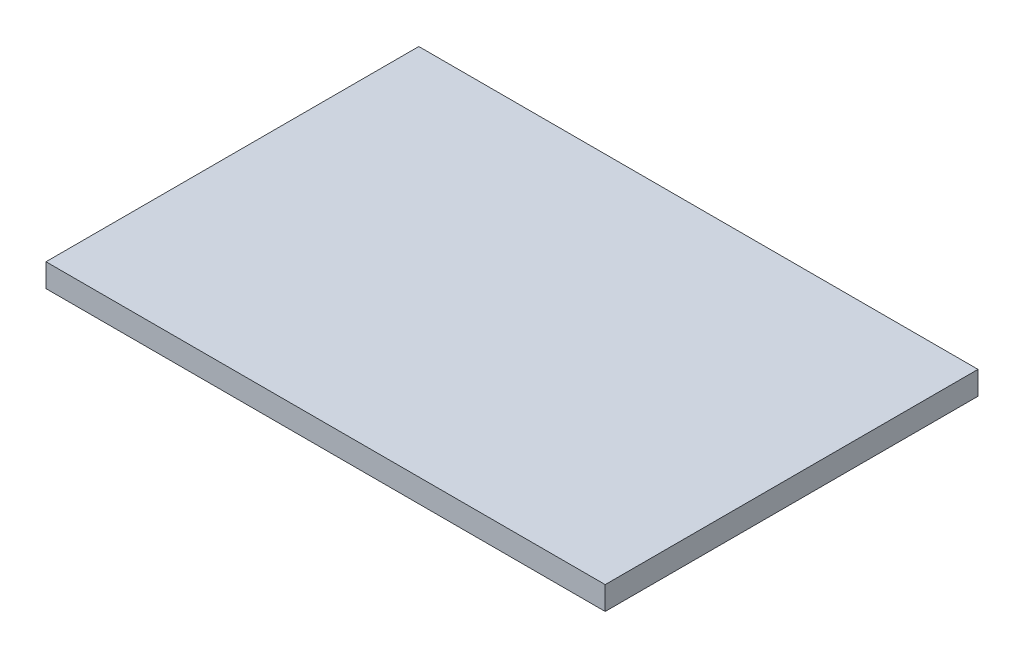
ISO-10303-21;
HEADER;
FILE_DESCRIPTION(('STEP AP214'),'2;1');
FILE_NAME('part.step','',(''),(''),'','','');
FILE_SCHEMA(('AUTOMOTIVE_DESIGN { 1 0 10303 214 1 1 1 1 }'));
ENDSEC;
DATA;
#1=APPLICATION_CONTEXT('core data for automotive mechanical design processes');
#2=APPLICATION_PROTOCOL_DEFINITION('international standard','automotive_design',2000,#1);
#3=PRODUCT_CONTEXT('',#1,'mechanical');
#4=PRODUCT('Part','Part','',(#3));
#5=PRODUCT_RELATED_PRODUCT_CATEGORY('part','',(#4));
#6=PRODUCT_DEFINITION_FORMATION('','',#4);
#7=PRODUCT_DEFINITION_CONTEXT('part definition',#1,'design');
#8=PRODUCT_DEFINITION('design','',#6,#7);
#9=PRODUCT_DEFINITION_SHAPE('','',#8);
#10=(LENGTH_UNIT() NAMED_UNIT(*) SI_UNIT(.MILLI.,.METRE.));
#11=(NAMED_UNIT(*) PLANE_ANGLE_UNIT() SI_UNIT($,.RADIAN.));
#12=(NAMED_UNIT(*) SI_UNIT($,.STERADIAN.) SOLID_ANGLE_UNIT());
#13=UNCERTAINTY_MEASURE_WITH_UNIT(LENGTH_MEASURE(1.E-05),#10,'distance_accuracy_value','');
#14=(GEOMETRIC_REPRESENTATION_CONTEXT(3) GLOBAL_UNCERTAINTY_ASSIGNED_CONTEXT((#13)) GLOBAL_UNIT_ASSIGNED_CONTEXT((#10,
#11,#12)) REPRESENTATION_CONTEXT('',''));
#15=CARTESIAN_POINT('',(0.,0.,0.));
#16=DIRECTION('',(0.,0.,1.));
#17=DIRECTION('',(1.,0.,0.));
#18=AXIS2_PLACEMENT_3D('',#15,#16,#17);
#19=CARTESIAN_POINT('',(0.,6.35,0.));
#20=DIRECTION('',(1.,0.,0.));
#21=DIRECTION('',(0.,0.,-1.));
#22=AXIS2_PLACEMENT_3D('',#19,#20,#21);
#23=PLANE('',#22);
#24=DIRECTION('',(0.,0.,1.));
#25=VECTOR('',#24,1.);
#26=CARTESIAN_POINT('',(0.,0.,0.));
#27=LINE('',#26,#25);
#28=CARTESIAN_POINT('',(0.,0.,-101.6));
#29=VERTEX_POINT('',#28);
#30=CARTESIAN_POINT('',(0.,0.,0.));
#31=VERTEX_POINT('',#30);
#32=EDGE_CURVE('E98',#29,#31,#27,.T.);
#33=ORIENTED_EDGE('',*,*,#32,.T.);
#34=DIRECTION('',(0.,-1.,0.));
#35=VECTOR('',#34,1.);
#36=CARTESIAN_POINT('',(0.,6.35,0.));
#37=LINE('',#36,#35);
#38=CARTESIAN_POINT('',(0.,6.35,0.));
#39=VERTEX_POINT('',#38);
#40=EDGE_CURVE('E11',#39,#31,#37,.T.);
#41=ORIENTED_EDGE('',*,*,#40,.F.);
#42=DIRECTION('',(0.,0.,1.));
#43=VECTOR('',#42,1.);
#44=CARTESIAN_POINT('',(0.,6.35,0.));
#45=LINE('',#44,#43);
#46=CARTESIAN_POINT('',(0.,6.35,-101.6));
#47=VERTEX_POINT('',#46);
#48=EDGE_CURVE('E86',#47,#39,#45,.T.);
#49=ORIENTED_EDGE('',*,*,#48,.F.);
#50=DIRECTION('',(0.,-1.,0.));
#51=VECTOR('',#50,1.);
#52=CARTESIAN_POINT('',(0.,6.35,-101.6));
#53=LINE('',#52,#51);
#54=EDGE_CURVE('E94',#47,#29,#53,.T.);
#55=ORIENTED_EDGE('',*,*,#54,.T.);
#56=EDGE_LOOP('',(#33,#41,#49,#55));
#57=FACE_BOUND('',#56,.T.);
#58=ADVANCED_FACE('F35',(#57),#23,.F.);
#59=CARTESIAN_POINT('',(0.,6.35,0.));
#60=DIRECTION('',(0.,0.,-1.));
#61=DIRECTION('',(-1.,0.,0.));
#62=AXIS2_PLACEMENT_3D('',#59,#60,#61);
#63=PLANE('',#62);
#64=DIRECTION('',(1.,0.,0.));
#65=VECTOR('',#64,1.);
#66=CARTESIAN_POINT('',(0.,0.,0.));
#67=LINE('',#66,#65);
#68=CARTESIAN_POINT('',(152.4,0.,0.));
#69=VERTEX_POINT('',#68);
#70=EDGE_CURVE('E90',#31,#69,#67,.T.);
#71=ORIENTED_EDGE('',*,*,#70,.T.);
#72=DIRECTION('',(0.,-1.,0.));
#73=VECTOR('',#72,1.);
#74=CARTESIAN_POINT('',(152.4,6.35,0.));
#75=LINE('',#74,#73);
#76=CARTESIAN_POINT('',(152.4,6.35,0.));
#77=VERTEX_POINT('',#76);
#78=EDGE_CURVE('E43',#77,#69,#75,.T.);
#79=ORIENTED_EDGE('',*,*,#78,.F.);
#80=DIRECTION('',(1.,0.,0.));
#81=VECTOR('',#80,1.);
#82=CARTESIAN_POINT('',(0.,6.35,0.));
#83=LINE('',#82,#81);
#84=EDGE_CURVE('E81',#39,#77,#83,.T.);
#85=ORIENTED_EDGE('',*,*,#84,.F.);
#86=ORIENTED_EDGE('',*,*,#40,.T.);
#87=EDGE_LOOP('',(#71,#79,#85,#86));
#88=FACE_BOUND('',#87,.T.);
#89=ADVANCED_FACE('F89',(#88),#63,.F.);
#90=CARTESIAN_POINT('',(152.4,6.35,0.));
#91=DIRECTION('',(-1.,0.,0.));
#92=DIRECTION('',(0.,0.,1.));
#93=AXIS2_PLACEMENT_3D('',#90,#91,#92);
#94=PLANE('',#93);
#95=DIRECTION('',(0.,0.,-1.));
#96=VECTOR('',#95,1.);
#97=CARTESIAN_POINT('',(152.4,0.,0.));
#98=LINE('',#97,#96);
#99=CARTESIAN_POINT('',(152.4,0.,-101.6));
#100=VERTEX_POINT('',#99);
#101=EDGE_CURVE('E68',#69,#100,#98,.T.);
#102=ORIENTED_EDGE('',*,*,#101,.T.);
#103=DIRECTION('',(0.,-1.,0.));
#104=VECTOR('',#103,1.);
#105=CARTESIAN_POINT('',(152.4,6.35,-101.6));
#106=LINE('',#105,#104);
#107=CARTESIAN_POINT('',(152.4,6.35,-101.6));
#108=VERTEX_POINT('',#107);
#109=EDGE_CURVE('E91',#108,#100,#106,.T.);
#110=ORIENTED_EDGE('',*,*,#109,.F.);
#111=DIRECTION('',(0.,0.,-1.));
#112=VECTOR('',#111,1.);
#113=CARTESIAN_POINT('',(152.4,6.35,0.));
#114=LINE('',#113,#112);
#115=EDGE_CURVE('E84',#77,#108,#114,.T.);
#116=ORIENTED_EDGE('',*,*,#115,.F.);
#117=ORIENTED_EDGE('',*,*,#78,.T.);
#118=EDGE_LOOP('',(#102,#110,#116,#117));
#119=FACE_BOUND('',#118,.T.);
#120=ADVANCED_FACE('F92',(#119),#94,.F.);
#121=CARTESIAN_POINT('',(0.,6.35,-101.6));
#122=DIRECTION('',(0.,0.,1.));
#123=DIRECTION('',(1.,0.,0.));
#124=AXIS2_PLACEMENT_3D('',#121,#122,#123);
#125=PLANE('',#124);
#126=DIRECTION('',(-1.,0.,0.));
#127=VECTOR('',#126,1.);
#128=CARTESIAN_POINT('',(0.,0.,-101.6));
#129=LINE('',#128,#127);
#130=EDGE_CURVE('E74',#100,#29,#129,.T.);
#131=ORIENTED_EDGE('',*,*,#130,.T.);
#132=ORIENTED_EDGE('',*,*,#54,.F.);
#133=DIRECTION('',(-1.,0.,0.));
#134=VECTOR('',#133,1.);
#135=CARTESIAN_POINT('',(0.,6.35,-101.6));
#136=LINE('',#135,#134);
#137=EDGE_CURVE('E51',#108,#47,#136,.T.);
#138=ORIENTED_EDGE('',*,*,#137,.F.);
#139=ORIENTED_EDGE('',*,*,#109,.T.);
#140=EDGE_LOOP('',(#131,#132,#138,#139));
#141=FACE_BOUND('',#140,.T.);
#142=ADVANCED_FACE('F105',(#141),#125,.F.);
#143=CARTESIAN_POINT('',(0.,6.35,0.));
#144=DIRECTION('',(0.,-1.,0.));
#145=DIRECTION('',(0.,0.,-1.));
#146=AXIS2_PLACEMENT_3D('',#143,#144,#145);
#147=PLANE('',#146);
#148=ORIENTED_EDGE('',*,*,#48,.T.);
#149=ORIENTED_EDGE('',*,*,#84,.T.);
#150=ORIENTED_EDGE('',*,*,#115,.T.);
#151=ORIENTED_EDGE('',*,*,#137,.T.);
#152=EDGE_LOOP('',(#148,#149,#150,#151));
#153=FACE_BOUND('',#152,.T.);
#154=ADVANCED_FACE('F82',(#153),#147,.F.);
#155=CARTESIAN_POINT('',(0.,0.,0.));
#156=DIRECTION('',(0.,-1.,0.));
#157=DIRECTION('',(0.,0.,-1.));
#158=AXIS2_PLACEMENT_3D('',#155,#156,#157);
#159=PLANE('',#158);
#160=ORIENTED_EDGE('',*,*,#32,.F.);
#161=ORIENTED_EDGE('',*,*,#130,.F.);
#162=ORIENTED_EDGE('',*,*,#101,.F.);
#163=ORIENTED_EDGE('',*,*,#70,.F.);
#164=EDGE_LOOP('',(#160,#161,#162,#163));
#165=FACE_BOUND('',#164,.T.);
#166=ADVANCED_FACE('F108',(#165),#159,.T.);
#167=CLOSED_SHELL('',(#58,#89,#120,#142,#154,#166));
#168=MANIFOLD_SOLID_BREP('B2',#167);
#169=ADVANCED_BREP_SHAPE_REPRESENTATION('',(#18,#168),#14);
#170=SHAPE_DEFINITION_REPRESENTATION(#9,#169);
ENDSEC;
END-ISO-10303-21;
